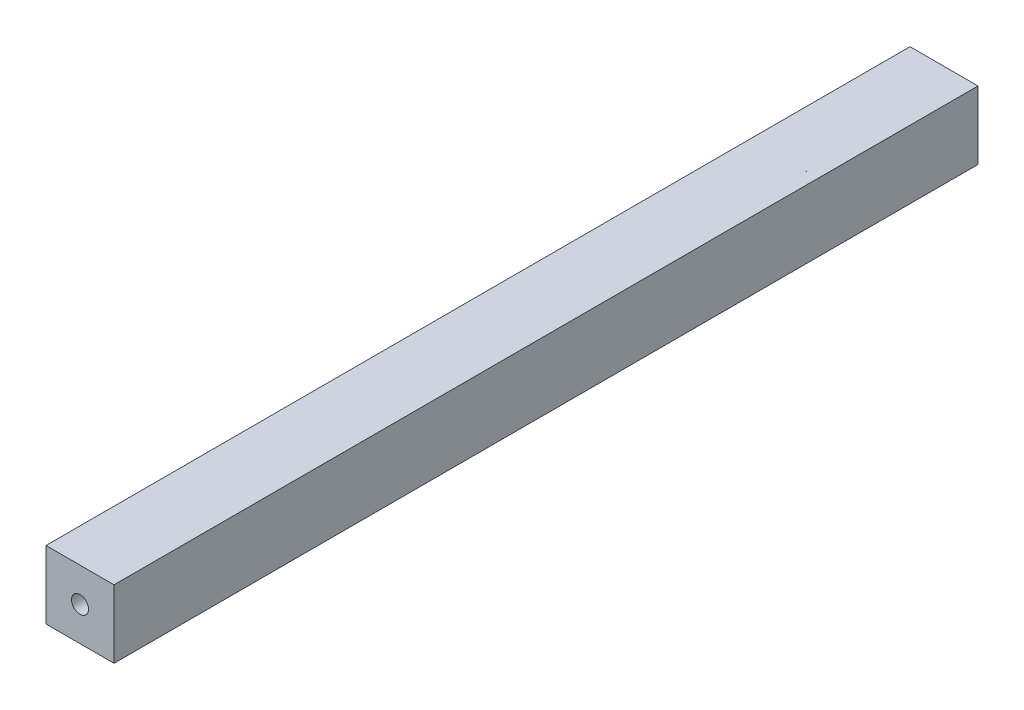
ISO-10303-21;
HEADER;
FILE_DESCRIPTION(('STEP AP214'),'2;1');
FILE_NAME('part.step','',(''),(''),'','','');
FILE_SCHEMA(('AUTOMOTIVE_DESIGN { 1 0 10303 214 1 1 1 1 }'));
ENDSEC;
DATA;
#1=APPLICATION_CONTEXT('core data for automotive mechanical design processes');
#2=APPLICATION_PROTOCOL_DEFINITION('international standard','automotive_design',2000,#1);
#3=PRODUCT_CONTEXT('',#1,'mechanical');
#4=PRODUCT('Part','Part','',(#3));
#5=PRODUCT_RELATED_PRODUCT_CATEGORY('part','',(#4));
#6=PRODUCT_DEFINITION_FORMATION('','',#4);
#7=PRODUCT_DEFINITION_CONTEXT('part definition',#1,'design');
#8=PRODUCT_DEFINITION('design','',#6,#7);
#9=PRODUCT_DEFINITION_SHAPE('','',#8);
#10=(LENGTH_UNIT() NAMED_UNIT(*) SI_UNIT(.MILLI.,.METRE.));
#11=(NAMED_UNIT(*) PLANE_ANGLE_UNIT() SI_UNIT($,.RADIAN.));
#12=(NAMED_UNIT(*) SI_UNIT($,.STERADIAN.) SOLID_ANGLE_UNIT());
#13=UNCERTAINTY_MEASURE_WITH_UNIT(LENGTH_MEASURE(1.E-05),#10,'distance_accuracy_value','');
#14=(GEOMETRIC_REPRESENTATION_CONTEXT(3) GLOBAL_UNCERTAINTY_ASSIGNED_CONTEXT((#13)) GLOBAL_UNIT_ASSIGNED_CONTEXT((#10,
#11,#12)) REPRESENTATION_CONTEXT('',''));
#15=CARTESIAN_POINT('',(0.,0.,0.));
#16=DIRECTION('',(0.,0.,1.));
#17=DIRECTION('',(1.,0.,0.));
#18=AXIS2_PLACEMENT_3D('',#15,#16,#17);
#19=CARTESIAN_POINT('',(-10.,10.,254.));
#20=DIRECTION('',(1.,0.,0.));
#21=DIRECTION('',(0.,1.,0.));
#22=AXIS2_PLACEMENT_3D('',#19,#20,#21);
#23=PLANE('',#22);
#24=DIRECTION('',(0.,-1.,0.));
#25=VECTOR('',#24,1.);
#26=CARTESIAN_POINT('',(-10.,10.,0.));
#27=LINE('',#26,#25);
#28=CARTESIAN_POINT('',(-10.,10.,0.));
#29=VERTEX_POINT('',#28);
#30=CARTESIAN_POINT('',(-10.,-10.,0.));
#31=VERTEX_POINT('',#30);
#32=EDGE_CURVE('E106',#29,#31,#27,.T.);
#33=ORIENTED_EDGE('',*,*,#32,.T.);
#34=DIRECTION('',(0.,0.,-1.));
#35=VECTOR('',#34,1.);
#36=CARTESIAN_POINT('',(-10.,-10.,254.));
#37=LINE('',#36,#35);
#38=CARTESIAN_POINT('',(-10.,-10.,254.));
#39=VERTEX_POINT('',#38);
#40=EDGE_CURVE('E11',#39,#31,#37,.T.);
#41=ORIENTED_EDGE('',*,*,#40,.F.);
#42=DIRECTION('',(0.,-1.,0.));
#43=VECTOR('',#42,1.);
#44=CARTESIAN_POINT('',(-10.,10.,254.));
#45=LINE('',#44,#43);
#46=CARTESIAN_POINT('',(-10.,10.,254.));
#47=VERTEX_POINT('',#46);
#48=EDGE_CURVE('E90',#47,#39,#45,.T.);
#49=ORIENTED_EDGE('',*,*,#48,.F.);
#50=DIRECTION('',(0.,0.,-1.));
#51=VECTOR('',#50,1.);
#52=CARTESIAN_POINT('',(-10.,10.,254.));
#53=LINE('',#52,#51);
#54=EDGE_CURVE('E102',#47,#29,#53,.T.);
#55=ORIENTED_EDGE('',*,*,#54,.T.);
#56=EDGE_LOOP('',(#33,#41,#49,#55));
#57=FACE_BOUND('',#56,.T.);
#58=ADVANCED_FACE('F38',(#57),#23,.F.);
#59=CARTESIAN_POINT('',(10.,-10.,254.));
#60=DIRECTION('',(0.,1.,0.));
#61=DIRECTION('',(-1.,0.,0.));
#62=AXIS2_PLACEMENT_3D('',#59,#60,#61);
#63=PLANE('',#62);
#64=DIRECTION('',(1.,0.,0.));
#65=VECTOR('',#64,1.);
#66=CARTESIAN_POINT('',(10.,-10.,0.));
#67=LINE('',#66,#65);
#68=CARTESIAN_POINT('',(10.,-10.,0.));
#69=VERTEX_POINT('',#68);
#70=EDGE_CURVE('E95',#31,#69,#67,.T.);
#71=ORIENTED_EDGE('',*,*,#70,.T.);
#72=DIRECTION('',(0.,0.,-1.));
#73=VECTOR('',#72,1.);
#74=CARTESIAN_POINT('',(10.,-10.,254.));
#75=LINE('',#74,#73);
#76=CARTESIAN_POINT('',(10.,-10.,254.));
#77=VERTEX_POINT('',#76);
#78=EDGE_CURVE('E47',#77,#69,#75,.T.);
#79=ORIENTED_EDGE('',*,*,#78,.F.);
#80=DIRECTION('',(1.,0.,0.));
#81=VECTOR('',#80,1.);
#82=CARTESIAN_POINT('',(10.,-10.,254.));
#83=LINE('',#82,#81);
#84=EDGE_CURVE('E85',#39,#77,#83,.T.);
#85=ORIENTED_EDGE('',*,*,#84,.F.);
#86=ORIENTED_EDGE('',*,*,#40,.T.);
#87=EDGE_LOOP('',(#71,#79,#85,#86));
#88=FACE_BOUND('',#87,.T.);
#89=ADVANCED_FACE('F94',(#88),#63,.F.);
#90=CARTESIAN_POINT('',(10.,10.,254.));
#91=DIRECTION('',(-1.,0.,0.));
#92=DIRECTION('',(0.,-1.,0.));
#93=AXIS2_PLACEMENT_3D('',#90,#91,#92);
#94=PLANE('',#93);
#95=DIRECTION('',(0.,1.,0.));
#96=VECTOR('',#95,1.);
#97=CARTESIAN_POINT('',(10.,10.,0.));
#98=LINE('',#97,#96);
#99=CARTESIAN_POINT('',(10.,10.,0.));
#100=VERTEX_POINT('',#99);
#101=EDGE_CURVE('E72',#69,#100,#98,.T.);
#102=ORIENTED_EDGE('',*,*,#101,.T.);
#103=DIRECTION('',(0.,0.,-1.));
#104=VECTOR('',#103,1.);
#105=CARTESIAN_POINT('',(10.,10.,254.));
#106=LINE('',#105,#104);
#107=CARTESIAN_POINT('',(10.,10.,254.));
#108=VERTEX_POINT('',#107);
#109=EDGE_CURVE('E97',#108,#100,#106,.T.);
#110=ORIENTED_EDGE('',*,*,#109,.F.);
#111=DIRECTION('',(0.,1.,0.));
#112=VECTOR('',#111,1.);
#113=CARTESIAN_POINT('',(10.,10.,254.));
#114=LINE('',#113,#112);
#115=EDGE_CURVE('E88',#77,#108,#114,.T.);
#116=ORIENTED_EDGE('',*,*,#115,.F.);
#117=ORIENTED_EDGE('',*,*,#78,.T.);
#118=EDGE_LOOP('',(#102,#110,#116,#117));
#119=FACE_BOUND('',#118,.T.);
#120=ADVANCED_FACE('F98',(#119),#94,.F.);
#121=CARTESIAN_POINT('',(10.,10.,254.));
#122=DIRECTION('',(0.,-1.,0.));
#123=DIRECTION('',(1.,0.,0.));
#124=AXIS2_PLACEMENT_3D('',#121,#122,#123);
#125=PLANE('',#124);
#126=DIRECTION('',(-1.,0.,0.));
#127=VECTOR('',#126,1.);
#128=CARTESIAN_POINT('',(10.,10.,0.));
#129=LINE('',#128,#127);
#130=EDGE_CURVE('E78',#100,#29,#129,.T.);
#131=ORIENTED_EDGE('',*,*,#130,.T.);
#132=ORIENTED_EDGE('',*,*,#54,.F.);
#133=DIRECTION('',(-1.,0.,0.));
#134=VECTOR('',#133,1.);
#135=CARTESIAN_POINT('',(10.,10.,254.));
#136=LINE('',#135,#134);
#137=EDGE_CURVE('E55',#108,#47,#136,.T.);
#138=ORIENTED_EDGE('',*,*,#137,.F.);
#139=ORIENTED_EDGE('',*,*,#109,.T.);
#140=EDGE_LOOP('',(#131,#132,#138,#139));
#141=FACE_BOUND('',#140,.T.);
#142=ADVANCED_FACE('F120',(#141),#125,.F.);
#143=CARTESIAN_POINT('',(0.,0.,254.));
#144=DIRECTION('',(0.,0.,-1.));
#145=DIRECTION('',(-1.,0.,0.));
#146=AXIS2_PLACEMENT_3D('',#143,#144,#145);
#147=PLANE('',#146);
#148=CARTESIAN_POINT('',(0.,0.,254.));
#149=DIRECTION('',(0.,0.,1.));
#150=DIRECTION('',(1.,0.,0.));
#151=AXIS2_PLACEMENT_3D('',#148,#149,#150);
#152=CIRCLE('',#151,2.5);
#153=CARTESIAN_POINT('',(2.5,0.,254.));
#154=VERTEX_POINT('',#153);
#155=EDGE_CURVE('E130',#154,#154,#152,.T.);
#156=ORIENTED_EDGE('',*,*,#155,.F.);
#157=EDGE_LOOP('',(#156));
#158=FACE_BOUND('',#157,.T.);
#159=ORIENTED_EDGE('',*,*,#48,.T.);
#160=ORIENTED_EDGE('',*,*,#84,.T.);
#161=ORIENTED_EDGE('',*,*,#115,.T.);
#162=ORIENTED_EDGE('',*,*,#137,.T.);
#163=EDGE_LOOP('',(#159,#160,#161,#162));
#164=FACE_BOUND('',#163,.T.);
#165=ADVANCED_FACE('F86',(#158,#164),#147,.F.);
#166=CARTESIAN_POINT('',(0.,0.,0.));
#167=DIRECTION('',(0.,0.,-1.));
#168=DIRECTION('',(-1.,0.,0.));
#169=AXIS2_PLACEMENT_3D('',#166,#167,#168);
#170=PLANE('',#169);
#171=CARTESIAN_POINT('',(0.,0.,0.));
#172=DIRECTION('',(0.,0.,-1.));
#173=DIRECTION('',(-1.,0.,0.));
#174=AXIS2_PLACEMENT_3D('',#171,#172,#173);
#175=CIRCLE('',#174,2.5);
#176=CARTESIAN_POINT('',(-2.5,0.,0.));
#177=VERTEX_POINT('',#176);
#178=EDGE_CURVE('E110',#177,#177,#175,.F.);
#179=ORIENTED_EDGE('',*,*,#178,.T.);
#180=EDGE_LOOP('',(#179));
#181=FACE_BOUND('',#180,.T.);
#182=ORIENTED_EDGE('',*,*,#32,.F.);
#183=ORIENTED_EDGE('',*,*,#130,.F.);
#184=ORIENTED_EDGE('',*,*,#101,.F.);
#185=ORIENTED_EDGE('',*,*,#70,.F.);
#186=EDGE_LOOP('',(#182,#183,#184,#185));
#187=FACE_BOUND('',#186,.T.);
#188=ADVANCED_FACE('F123',(#181,#187),#170,.T.);
#189=CARTESIAN_POINT('',(0.,0.,-7.07106781186551));
#190=DIRECTION('',(0.,0.,1.));
#191=DIRECTION('',(1.,0.,0.));
#192=AXIS2_PLACEMENT_3D('',#189,#190,#191);
#193=CYLINDRICAL_SURFACE('',#192,2.5);
#194=ORIENTED_EDGE('',*,*,#155,.T.);
#195=EDGE_LOOP('',(#194));
#196=FACE_BOUND('',#195,.T.);
#197=ORIENTED_EDGE('',*,*,#178,.F.);
#198=EDGE_LOOP('',(#197));
#199=FACE_BOUND('',#198,.T.);
#200=ADVANCED_FACE('F135',(#196,#199),#193,.F.);
#201=CLOSED_SHELL('',(#58,#89,#120,#142,#165,#188,#200));
#202=MANIFOLD_SOLID_BREP('B2',#201);
#203=ADVANCED_BREP_SHAPE_REPRESENTATION('',(#18,#202),#14);
#204=SHAPE_DEFINITION_REPRESENTATION(#9,#203);
ENDSEC;
END-ISO-10303-21;
